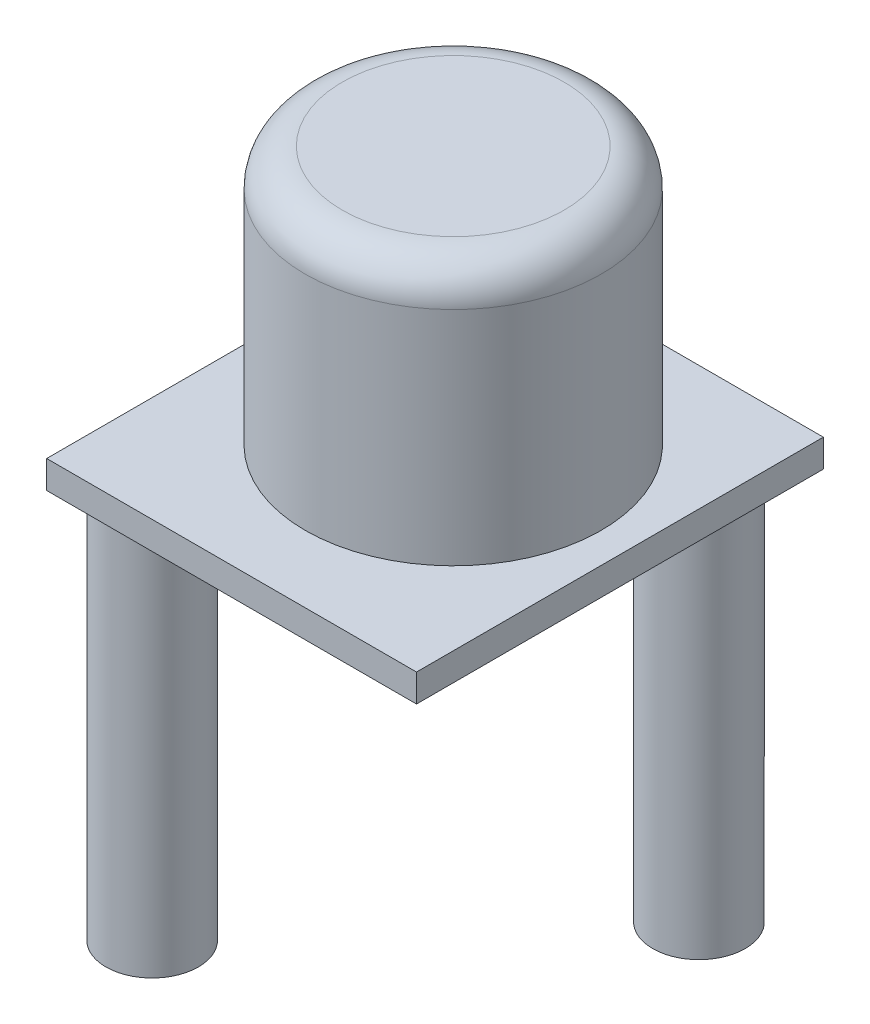
ISO-10303-21;
HEADER;
FILE_DESCRIPTION(('STEP AP214'),'2;1');
FILE_NAME('part.step','',(''),(''),'','','');
FILE_SCHEMA(('AUTOMOTIVE_DESIGN { 1 0 10303 214 1 1 1 1 }'));
ENDSEC;
DATA;
#1=APPLICATION_CONTEXT('core data for automotive mechanical design processes');
#2=APPLICATION_PROTOCOL_DEFINITION('international standard','automotive_design',2000,#1);
#3=PRODUCT_CONTEXT('',#1,'mechanical');
#4=PRODUCT('Part','Part','',(#3));
#5=PRODUCT_RELATED_PRODUCT_CATEGORY('part','',(#4));
#6=PRODUCT_DEFINITION_FORMATION('','',#4);
#7=PRODUCT_DEFINITION_CONTEXT('part definition',#1,'design');
#8=PRODUCT_DEFINITION('design','',#6,#7);
#9=PRODUCT_DEFINITION_SHAPE('','',#8);
#10=(LENGTH_UNIT() NAMED_UNIT(*) SI_UNIT(.MILLI.,.METRE.));
#11=(NAMED_UNIT(*) PLANE_ANGLE_UNIT() SI_UNIT($,.RADIAN.));
#12=(NAMED_UNIT(*) SI_UNIT($,.STERADIAN.) SOLID_ANGLE_UNIT());
#13=UNCERTAINTY_MEASURE_WITH_UNIT(LENGTH_MEASURE(1.E-05),#10,'distance_accuracy_value','');
#14=(GEOMETRIC_REPRESENTATION_CONTEXT(3) GLOBAL_UNCERTAINTY_ASSIGNED_CONTEXT((#13)) GLOBAL_UNIT_ASSIGNED_CONTEXT((#10,
#11,#12)) REPRESENTATION_CONTEXT('',''));
#15=CARTESIAN_POINT('',(0.,0.,0.));
#16=DIRECTION('',(0.,0.,1.));
#17=DIRECTION('',(1.,0.,0.));
#18=AXIS2_PLACEMENT_3D('',#15,#16,#17);
#19=CARTESIAN_POINT('',(0.,0.,0.));
#20=DIRECTION('',(0.,1.,0.));
#21=DIRECTION('',(0.,0.,1.));
#22=AXIS2_PLACEMENT_3D('',#19,#20,#21);
#23=PLANE('',#22);
#24=CARTESIAN_POINT('',(6.47923528502048,0.,-5.22425999684373));
#25=DIRECTION('',(0.,1.,0.));
#26=DIRECTION('',(0.,0.,1.));
#27=AXIS2_PLACEMENT_3D('',#24,#25,#26);
#28=CIRCLE('',#27,2.5);
#29=CARTESIAN_POINT('',(6.47923528502048,0.,-2.72425999684373));
#30=VERTEX_POINT('',#29);
#31=EDGE_CURVE('E11',#30,#30,#28,.F.);
#32=ORIENTED_EDGE('',*,*,#31,.F.);
#33=EDGE_LOOP('',(#32));
#34=FACE_BOUND('',#33,.T.);
#35=DIRECTION('',(0.,0.,1.));
#36=VECTOR('',#35,1.);
#37=CARTESIAN_POINT('',(-10.3630333982392,0.,-8.79286353854923));
#38=LINE('',#37,#36);
#39=CARTESIAN_POINT('',(-10.3630333982392,0.,-8.79286353854923));
#40=VERTEX_POINT('',#39);
#41=CARTESIAN_POINT('',(-10.3630333982392,0.,13.2071364614508));
#42=VERTEX_POINT('',#41);
#43=EDGE_CURVE('E137',#40,#42,#38,.T.);
#44=ORIENTED_EDGE('',*,*,#43,.F.);
#45=DIRECTION('',(-1.,0.,0.));
#46=VECTOR('',#45,1.);
#47=CARTESIAN_POINT('',(-10.3630333982392,0.,-8.79286353854923));
#48=LINE('',#47,#46);
#49=CARTESIAN_POINT('',(9.63696660176083,0.,-8.79286353854923));
#50=VERTEX_POINT('',#49);
#51=EDGE_CURVE('E142',#50,#40,#48,.T.);
#52=ORIENTED_EDGE('',*,*,#51,.F.);
#53=DIRECTION('',(0.,0.,-1.));
#54=VECTOR('',#53,1.);
#55=CARTESIAN_POINT('',(9.63696660176083,0.,-8.79286353854923));
#56=LINE('',#55,#54);
#57=CARTESIAN_POINT('',(9.63696660176084,0.,13.2071364614508));
#58=VERTEX_POINT('',#57);
#59=EDGE_CURVE('E153',#58,#50,#56,.T.);
#60=ORIENTED_EDGE('',*,*,#59,.F.);
#61=DIRECTION('',(1.,0.,0.));
#62=VECTOR('',#61,1.);
#63=CARTESIAN_POINT('',(-10.3630333982392,0.,13.2071364614508));
#64=LINE('',#63,#62);
#65=EDGE_CURVE('E151',#42,#58,#64,.T.);
#66=ORIENTED_EDGE('',*,*,#65,.F.);
#67=EDGE_LOOP('',(#44,#52,#60,#66));
#68=FACE_BOUND('',#67,.T.);
#69=CARTESIAN_POINT('',(-7.44614942787791,0.,10.4204529690932));
#70=DIRECTION('',(0.,1.,0.));
#71=DIRECTION('',(0.,0.,1.));
#72=AXIS2_PLACEMENT_3D('',#69,#70,#71);
#73=CIRCLE('',#72,2.5);
#74=CARTESIAN_POINT('',(-7.44614942787791,0.,12.9204529690932));
#75=VERTEX_POINT('',#74);
#76=EDGE_CURVE('E45',#75,#75,#73,.F.);
#77=ORIENTED_EDGE('',*,*,#76,.F.);
#78=EDGE_LOOP('',(#77));
#79=FACE_BOUND('',#78,.T.);
#80=DIRECTION('',(0.,0.,-1.));
#81=VECTOR('',#80,1.);
#82=CARTESIAN_POINT('',(-8.36303339823917,0.,-4.79286353854923));
#83=LINE('',#82,#81);
#84=CARTESIAN_POINT('',(-8.36303339823917,0.,3.20713646145077));
#85=VERTEX_POINT('',#84);
#86=CARTESIAN_POINT('',(-8.36303339823917,0.,-4.79286353854923));
#87=VERTEX_POINT('',#86);
#88=EDGE_CURVE('E122',#85,#87,#83,.T.);
#89=ORIENTED_EDGE('',*,*,#88,.F.);
#90=DIRECTION('',(-1.,0.,0.));
#91=VECTOR('',#90,1.);
#92=CARTESIAN_POINT('',(-8.36303339823917,0.,3.20713646145077));
#93=LINE('',#92,#91);
#94=CARTESIAN_POINT('',(-0.363033398239169,0.,3.20713646145077));
#95=VERTEX_POINT('',#94);
#96=EDGE_CURVE('E119',#95,#85,#93,.T.);
#97=ORIENTED_EDGE('',*,*,#96,.F.);
#98=DIRECTION('',(0.,0.,1.));
#99=VECTOR('',#98,1.);
#100=CARTESIAN_POINT('',(-0.363033398239168,0.,-4.79286353854923));
#101=LINE('',#100,#99);
#102=CARTESIAN_POINT('',(-0.363033398239168,0.,-4.79286353854923));
#103=VERTEX_POINT('',#102);
#104=EDGE_CURVE('E57',#103,#95,#101,.T.);
#105=ORIENTED_EDGE('',*,*,#104,.F.);
#106=DIRECTION('',(1.,0.,0.));
#107=VECTOR('',#106,1.);
#108=CARTESIAN_POINT('',(-8.36303339823917,0.,-4.79286353854923));
#109=LINE('',#108,#107);
#110=EDGE_CURVE('E52',#87,#103,#109,.T.);
#111=ORIENTED_EDGE('',*,*,#110,.F.);
#112=EDGE_LOOP('',(#89,#97,#105,#111));
#113=FACE_BOUND('',#112,.T.);
#114=ADVANCED_FACE('F37',(#34,#68,#79,#113),#23,.F.);
#115=CARTESIAN_POINT('',(0.,1.5,0.));
#116=DIRECTION('',(0.,1.,0.));
#117=DIRECTION('',(0.,0.,1.));
#118=AXIS2_PLACEMENT_3D('',#115,#116,#117);
#119=PLANE('',#118);
#120=DIRECTION('',(0.,0.,1.));
#121=VECTOR('',#120,1.);
#122=CARTESIAN_POINT('',(-10.3630333982392,1.5,-8.79286353854923));
#123=LINE('',#122,#121);
#124=CARTESIAN_POINT('',(-10.3630333982392,1.5,-8.79286353854923));
#125=VERTEX_POINT('',#124);
#126=CARTESIAN_POINT('',(-10.3630333982392,1.5,13.2071364614508));
#127=VERTEX_POINT('',#126);
#128=EDGE_CURVE('E138',#125,#127,#123,.T.);
#129=ORIENTED_EDGE('',*,*,#128,.T.);
#130=DIRECTION('',(1.,0.,0.));
#131=VECTOR('',#130,1.);
#132=CARTESIAN_POINT('',(-10.3630333982392,1.5,13.2071364614508));
#133=LINE('',#132,#131);
#134=CARTESIAN_POINT('',(9.63696660176084,1.5,13.2071364614508));
#135=VERTEX_POINT('',#134);
#136=EDGE_CURVE('E141',#127,#135,#133,.T.);
#137=ORIENTED_EDGE('',*,*,#136,.T.);
#138=DIRECTION('',(0.,0.,-1.));
#139=VECTOR('',#138,1.);
#140=CARTESIAN_POINT('',(9.63696660176083,1.5,-8.79286353854923));
#141=LINE('',#140,#139);
#142=CARTESIAN_POINT('',(9.63696660176083,1.5,-8.79286353854923));
#143=VERTEX_POINT('',#142);
#144=EDGE_CURVE('E144',#135,#143,#141,.T.);
#145=ORIENTED_EDGE('',*,*,#144,.T.);
#146=DIRECTION('',(-1.,0.,0.));
#147=VECTOR('',#146,1.);
#148=CARTESIAN_POINT('',(-10.3630333982392,1.5,-8.79286353854923));
#149=LINE('',#148,#147);
#150=EDGE_CURVE('E146',#143,#125,#149,.T.);
#151=ORIENTED_EDGE('',*,*,#150,.T.);
#152=EDGE_LOOP('',(#129,#137,#145,#151));
#153=FACE_BOUND('',#152,.T.);
#154=CARTESIAN_POINT('',(0.,1.5,1.58481896102103));
#155=DIRECTION('',(0.,1.,0.));
#156=DIRECTION('',(0.,0.,1.));
#157=AXIS2_PLACEMENT_3D('',#154,#155,#156);
#158=CIRCLE('',#157,8.);
#159=CARTESIAN_POINT('',(0.,1.5,9.58481896102103));
#160=VERTEX_POINT('',#159);
#161=EDGE_CURVE('E134',#160,#160,#158,.T.);
#162=ORIENTED_EDGE('',*,*,#161,.F.);
#163=EDGE_LOOP('',(#162));
#164=FACE_BOUND('',#163,.T.);
#165=ADVANCED_FACE('F178',(#153,#164),#119,.T.);
#166=CARTESIAN_POINT('',(-10.3630333982392,1.5,-8.79286353854923));
#167=DIRECTION('',(1.,0.,0.));
#168=DIRECTION('',(0.,0.,-1.));
#169=AXIS2_PLACEMENT_3D('',#166,#167,#168);
#170=PLANE('',#169);
#171=ORIENTED_EDGE('',*,*,#43,.T.);
#172=DIRECTION('',(0.,-1.,0.));
#173=VECTOR('',#172,1.);
#174=CARTESIAN_POINT('',(-10.3630333982392,1.5,13.2071364614508));
#175=LINE('',#174,#173);
#176=EDGE_CURVE('E164',#127,#42,#175,.T.);
#177=ORIENTED_EDGE('',*,*,#176,.F.);
#178=ORIENTED_EDGE('',*,*,#128,.F.);
#179=DIRECTION('',(0.,-1.,0.));
#180=VECTOR('',#179,1.);
#181=CARTESIAN_POINT('',(-10.3630333982392,1.5,-8.79286353854923));
#182=LINE('',#181,#180);
#183=EDGE_CURVE('E148',#125,#40,#182,.T.);
#184=ORIENTED_EDGE('',*,*,#183,.T.);
#185=EDGE_LOOP('',(#171,#177,#178,#184));
#186=FACE_BOUND('',#185,.T.);
#187=ADVANCED_FACE('F233',(#186),#170,.F.);
#188=CARTESIAN_POINT('',(-10.3630333982392,1.5,13.2071364614508));
#189=DIRECTION('',(0.,0.,-1.));
#190=DIRECTION('',(-1.,0.,0.));
#191=AXIS2_PLACEMENT_3D('',#188,#189,#190);
#192=PLANE('',#191);
#193=ORIENTED_EDGE('',*,*,#65,.T.);
#194=DIRECTION('',(0.,-1.,0.));
#195=VECTOR('',#194,1.);
#196=CARTESIAN_POINT('',(9.63696660176084,1.5,13.2071364614508));
#197=LINE('',#196,#195);
#198=EDGE_CURVE('E161',#135,#58,#197,.T.);
#199=ORIENTED_EDGE('',*,*,#198,.F.);
#200=ORIENTED_EDGE('',*,*,#136,.F.);
#201=ORIENTED_EDGE('',*,*,#176,.T.);
#202=EDGE_LOOP('',(#193,#199,#200,#201));
#203=FACE_BOUND('',#202,.T.);
#204=ADVANCED_FACE('F242',(#203),#192,.F.);
#205=CARTESIAN_POINT('',(9.63696660176083,1.5,-8.79286353854923));
#206=DIRECTION('',(-1.,0.,0.));
#207=DIRECTION('',(0.,0.,1.));
#208=AXIS2_PLACEMENT_3D('',#205,#206,#207);
#209=PLANE('',#208);
#210=ORIENTED_EDGE('',*,*,#59,.T.);
#211=DIRECTION('',(0.,-1.,0.));
#212=VECTOR('',#211,1.);
#213=CARTESIAN_POINT('',(9.63696660176083,1.5,-8.79286353854923));
#214=LINE('',#213,#212);
#215=EDGE_CURVE('E158',#143,#50,#214,.T.);
#216=ORIENTED_EDGE('',*,*,#215,.F.);
#217=ORIENTED_EDGE('',*,*,#144,.F.);
#218=ORIENTED_EDGE('',*,*,#198,.T.);
#219=EDGE_LOOP('',(#210,#216,#217,#218));
#220=FACE_BOUND('',#219,.T.);
#221=ADVANCED_FACE('F238',(#220),#209,.F.);
#222=CARTESIAN_POINT('',(-10.3630333982392,1.5,-8.79286353854923));
#223=DIRECTION('',(0.,0.,1.));
#224=DIRECTION('',(1.,0.,0.));
#225=AXIS2_PLACEMENT_3D('',#222,#223,#224);
#226=PLANE('',#225);
#227=ORIENTED_EDGE('',*,*,#51,.T.);
#228=ORIENTED_EDGE('',*,*,#183,.F.);
#229=ORIENTED_EDGE('',*,*,#150,.F.);
#230=ORIENTED_EDGE('',*,*,#215,.T.);
#231=EDGE_LOOP('',(#227,#228,#229,#230));
#232=FACE_BOUND('',#231,.T.);
#233=ADVANCED_FACE('F230',(#232),#226,.F.);
#234=CARTESIAN_POINT('',(0.,15.5,1.58481896102103));
#235=DIRECTION('',(0.,-1.,0.));
#236=DIRECTION('',(0.,0.,-1.));
#237=AXIS2_PLACEMENT_3D('',#234,#235,#236);
#238=CYLINDRICAL_SURFACE('',#237,8.);
#239=CARTESIAN_POINT('',(0.,13.5,1.58481896102103));
#240=DIRECTION('',(0.,1.,0.));
#241=DIRECTION('',(0.,0.,1.));
#242=AXIS2_PLACEMENT_3D('',#239,#240,#241);
#243=CIRCLE('',#242,8.);
#244=CARTESIAN_POINT('',(0.,13.5,9.58481896102103));
#245=VERTEX_POINT('',#244);
#246=EDGE_CURVE('E170',#245,#245,#243,.F.);
#247=ORIENTED_EDGE('',*,*,#246,.T.);
#248=EDGE_LOOP('',(#247));
#249=FACE_BOUND('',#248,.T.);
#250=ORIENTED_EDGE('',*,*,#161,.T.);
#251=EDGE_LOOP('',(#250));
#252=FACE_BOUND('',#251,.T.);
#253=ADVANCED_FACE('F226',(#249,#252),#238,.T.);
#254=CARTESIAN_POINT('',(0.,15.5,1.58481896102103));
#255=DIRECTION('',(0.,1.,0.));
#256=DIRECTION('',(0.,0.,1.));
#257=AXIS2_PLACEMENT_3D('',#254,#255,#256);
#258=PLANE('',#257);
#259=CARTESIAN_POINT('',(0.,15.5,1.58481896102103));
#260=DIRECTION('',(0.,1.,0.));
#261=DIRECTION('',(0.,0.,1.));
#262=AXIS2_PLACEMENT_3D('',#259,#260,#261);
#263=CIRCLE('',#262,6.);
#264=CARTESIAN_POINT('',(0.,15.5,7.58481896102103));
#265=VERTEX_POINT('',#264);
#266=EDGE_CURVE('E167',#265,#265,#263,.T.);
#267=ORIENTED_EDGE('',*,*,#266,.T.);
#268=EDGE_LOOP('',(#267));
#269=FACE_BOUND('',#268,.T.);
#270=ADVANCED_FACE('F223',(#269),#258,.T.);
#271=CARTESIAN_POINT('',(0.,13.5,1.58481896102103));
#272=DIRECTION('',(0.,1.,0.));
#273=DIRECTION('',(0.,0.,1.));
#274=AXIS2_PLACEMENT_3D('',#271,#272,#273);
#275=TOROIDAL_SURFACE('',#274,6.,2.);
#276=ORIENTED_EDGE('',*,*,#246,.F.);
#277=EDGE_LOOP('',(#276));
#278=FACE_BOUND('',#277,.T.);
#279=ORIENTED_EDGE('',*,*,#266,.F.);
#280=EDGE_LOOP('',(#279));
#281=FACE_BOUND('',#280,.T.);
#282=ADVANCED_FACE('F39',(#278,#281),#275,.T.);
#283=CARTESIAN_POINT('',(-7.44614942787791,-21.,10.4204529690932));
#284=DIRECTION('',(0.,1.,0.));
#285=DIRECTION('',(0.,0.,1.));
#286=AXIS2_PLACEMENT_3D('',#283,#284,#285);
#287=CYLINDRICAL_SURFACE('',#286,2.5);
#288=CARTESIAN_POINT('',(-7.44614942787791,-21.,10.4204529690932));
#289=DIRECTION('',(0.,-1.,0.));
#290=DIRECTION('',(0.,0.,-1.));
#291=AXIS2_PLACEMENT_3D('',#288,#289,#290);
#292=CIRCLE('',#291,2.5);
#293=CARTESIAN_POINT('',(-7.44614942787791,-21.,7.92045296909322));
#294=VERTEX_POINT('',#293);
#295=EDGE_CURVE('E126',#294,#294,#292,.T.);
#296=ORIENTED_EDGE('',*,*,#295,.F.);
#297=EDGE_LOOP('',(#296));
#298=FACE_BOUND('',#297,.T.);
#299=ORIENTED_EDGE('',*,*,#76,.T.);
#300=EDGE_LOOP('',(#299));
#301=FACE_BOUND('',#300,.T.);
#302=ADVANCED_FACE('F175',(#298,#301),#287,.T.);
#303=CARTESIAN_POINT('',(-7.44614942787791,-21.,10.4204529690932));
#304=DIRECTION('',(0.,-1.,0.));
#305=DIRECTION('',(0.,0.,-1.));
#306=AXIS2_PLACEMENT_3D('',#303,#304,#305);
#307=PLANE('',#306);
#308=ORIENTED_EDGE('',*,*,#295,.T.);
#309=EDGE_LOOP('',(#308));
#310=FACE_BOUND('',#309,.T.);
#311=ADVANCED_FACE('F215',(#310),#307,.T.);
#312=CARTESIAN_POINT('',(6.47923528502048,-21.,-5.22425999684373));
#313=DIRECTION('',(0.,1.,0.));
#314=DIRECTION('',(0.,0.,1.));
#315=AXIS2_PLACEMENT_3D('',#312,#313,#314);
#316=CYLINDRICAL_SURFACE('',#315,2.5);
#317=CARTESIAN_POINT('',(6.47923528502048,-21.,-5.22425999684373));
#318=DIRECTION('',(0.,-1.,0.));
#319=DIRECTION('',(0.,0.,-1.));
#320=AXIS2_PLACEMENT_3D('',#317,#318,#319);
#321=CIRCLE('',#320,2.5);
#322=CARTESIAN_POINT('',(6.47923528502048,-21.,-7.72425999684373));
#323=VERTEX_POINT('',#322);
#324=EDGE_CURVE('E123',#323,#323,#321,.T.);
#325=ORIENTED_EDGE('',*,*,#324,.F.);
#326=EDGE_LOOP('',(#325));
#327=FACE_BOUND('',#326,.T.);
#328=ORIENTED_EDGE('',*,*,#31,.T.);
#329=EDGE_LOOP('',(#328));
#330=FACE_BOUND('',#329,.T.);
#331=ADVANCED_FACE('F211',(#327,#330),#316,.T.);
#332=CARTESIAN_POINT('',(6.47923528502048,-21.,-5.22425999684373));
#333=DIRECTION('',(0.,-1.,0.));
#334=DIRECTION('',(0.,0.,-1.));
#335=AXIS2_PLACEMENT_3D('',#332,#333,#334);
#336=PLANE('',#335);
#337=ORIENTED_EDGE('',*,*,#324,.T.);
#338=EDGE_LOOP('',(#337));
#339=FACE_BOUND('',#338,.T.);
#340=ADVANCED_FACE('F208',(#339),#336,.T.);
#341=CARTESIAN_POINT('',(-8.36303339823917,-10.,-4.79286353854923));
#342=DIRECTION('',(1.,0.,0.));
#343=DIRECTION('',(0.,0.,-1.));
#344=AXIS2_PLACEMENT_3D('',#341,#342,#343);
#345=PLANE('',#344);
#346=ORIENTED_EDGE('',*,*,#88,.T.);
#347=DIRECTION('',(0.,1.,0.));
#348=VECTOR('',#347,1.);
#349=CARTESIAN_POINT('',(-8.36303339823917,-10.,-4.79286353854923));
#350=LINE('',#349,#348);
#351=CARTESIAN_POINT('',(-8.36303339823917,-10.,-4.79286353854923));
#352=VERTEX_POINT('',#351);
#353=EDGE_CURVE('E103',#352,#87,#350,.T.);
#354=ORIENTED_EDGE('',*,*,#353,.F.);
#355=DIRECTION('',(0.,0.,-1.));
#356=VECTOR('',#355,1.);
#357=CARTESIAN_POINT('',(-8.36303339823917,-10.,-4.79286353854923));
#358=LINE('',#357,#356);
#359=CARTESIAN_POINT('',(-8.36303339823917,-10.,3.20713646145077));
#360=VERTEX_POINT('',#359);
#361=EDGE_CURVE('E110',#360,#352,#358,.T.);
#362=ORIENTED_EDGE('',*,*,#361,.F.);
#363=DIRECTION('',(0.,1.,0.));
#364=VECTOR('',#363,1.);
#365=CARTESIAN_POINT('',(-8.36303339823917,-10.,3.20713646145077));
#366=LINE('',#365,#364);
#367=EDGE_CURVE('E186',#360,#85,#366,.T.);
#368=ORIENTED_EDGE('',*,*,#367,.T.);
#369=EDGE_LOOP('',(#346,#354,#362,#368));
#370=FACE_BOUND('',#369,.T.);
#371=ADVANCED_FACE('F121',(#370),#345,.F.);
#372=CARTESIAN_POINT('',(-8.36303339823917,-10.,-4.79286353854923));
#373=DIRECTION('',(0.,0.,1.));
#374=DIRECTION('',(1.,0.,0.));
#375=AXIS2_PLACEMENT_3D('',#372,#373,#374);
#376=PLANE('',#375);
#377=ORIENTED_EDGE('',*,*,#110,.T.);
#378=DIRECTION('',(0.,1.,0.));
#379=VECTOR('',#378,1.);
#380=CARTESIAN_POINT('',(-0.363033398239168,-10.,-4.79286353854923));
#381=LINE('',#380,#379);
#382=CARTESIAN_POINT('',(-0.363033398239168,-10.,-4.79286353854923));
#383=VERTEX_POINT('',#382);
#384=EDGE_CURVE('E106',#383,#103,#381,.T.);
#385=ORIENTED_EDGE('',*,*,#384,.F.);
#386=DIRECTION('',(1.,0.,0.));
#387=VECTOR('',#386,1.);
#388=CARTESIAN_POINT('',(-8.36303339823917,-10.,-4.79286353854923));
#389=LINE('',#388,#387);
#390=EDGE_CURVE('E99',#352,#383,#389,.T.);
#391=ORIENTED_EDGE('',*,*,#390,.F.);
#392=ORIENTED_EDGE('',*,*,#353,.T.);
#393=EDGE_LOOP('',(#377,#385,#391,#392));
#394=FACE_BOUND('',#393,.T.);
#395=ADVANCED_FACE('F101',(#394),#376,.F.);
#396=CARTESIAN_POINT('',(-0.363033398239168,-10.,-4.79286353854923));
#397=DIRECTION('',(-1.,0.,0.));
#398=DIRECTION('',(0.,0.,1.));
#399=AXIS2_PLACEMENT_3D('',#396,#397,#398);
#400=PLANE('',#399);
#401=ORIENTED_EDGE('',*,*,#104,.T.);
#402=DIRECTION('',(0.,1.,0.));
#403=VECTOR('',#402,1.);
#404=CARTESIAN_POINT('',(-0.363033398239169,-10.,3.20713646145077));
#405=LINE('',#404,#403);
#406=CARTESIAN_POINT('',(-0.363033398239169,-10.,3.20713646145077));
#407=VERTEX_POINT('',#406);
#408=EDGE_CURVE('E128',#407,#95,#405,.T.);
#409=ORIENTED_EDGE('',*,*,#408,.F.);
#410=DIRECTION('',(0.,0.,1.));
#411=VECTOR('',#410,1.);
#412=CARTESIAN_POINT('',(-0.363033398239168,-10.,-4.79286353854923));
#413=LINE('',#412,#411);
#414=EDGE_CURVE('E109',#383,#407,#413,.T.);
#415=ORIENTED_EDGE('',*,*,#414,.F.);
#416=ORIENTED_EDGE('',*,*,#384,.T.);
#417=EDGE_LOOP('',(#401,#409,#415,#416));
#418=FACE_BOUND('',#417,.T.);
#419=ADVANCED_FACE('F195',(#418),#400,.F.);
#420=CARTESIAN_POINT('',(-8.36303339823917,-10.,3.20713646145077));
#421=DIRECTION('',(0.,0.,-1.));
#422=DIRECTION('',(-1.,0.,0.));
#423=AXIS2_PLACEMENT_3D('',#420,#421,#422);
#424=PLANE('',#423);
#425=ORIENTED_EDGE('',*,*,#96,.T.);
#426=ORIENTED_EDGE('',*,*,#367,.F.);
#427=DIRECTION('',(-1.,0.,0.));
#428=VECTOR('',#427,1.);
#429=CARTESIAN_POINT('',(-8.36303339823917,-10.,3.20713646145077));
#430=LINE('',#429,#428);
#431=EDGE_CURVE('E115',#407,#360,#430,.T.);
#432=ORIENTED_EDGE('',*,*,#431,.F.);
#433=ORIENTED_EDGE('',*,*,#408,.T.);
#434=EDGE_LOOP('',(#425,#426,#432,#433));
#435=FACE_BOUND('',#434,.T.);
#436=ADVANCED_FACE('F185',(#435),#424,.F.);
#437=CARTESIAN_POINT('',(0.,-10.,0.));
#438=DIRECTION('',(0.,1.,0.));
#439=DIRECTION('',(0.,0.,1.));
#440=AXIS2_PLACEMENT_3D('',#437,#438,#439);
#441=PLANE('',#440);
#442=ORIENTED_EDGE('',*,*,#361,.T.);
#443=ORIENTED_EDGE('',*,*,#390,.T.);
#444=ORIENTED_EDGE('',*,*,#414,.T.);
#445=ORIENTED_EDGE('',*,*,#431,.T.);
#446=EDGE_LOOP('',(#442,#443,#444,#445));
#447=FACE_BOUND('',#446,.T.);
#448=ADVANCED_FACE('F113',(#447),#441,.F.);
#449=CLOSED_SHELL('',(#114,#165,#187,#204,#221,#233,#253,#270,#282,#302,#311,#331,#340,#371,
#395,#419,#436,#448));
#450=MANIFOLD_SOLID_BREP('B2',#449);
#451=ADVANCED_BREP_SHAPE_REPRESENTATION('',(#18,#450),#14);
#452=SHAPE_DEFINITION_REPRESENTATION(#9,#451);
ENDSEC;
END-ISO-10303-21;
